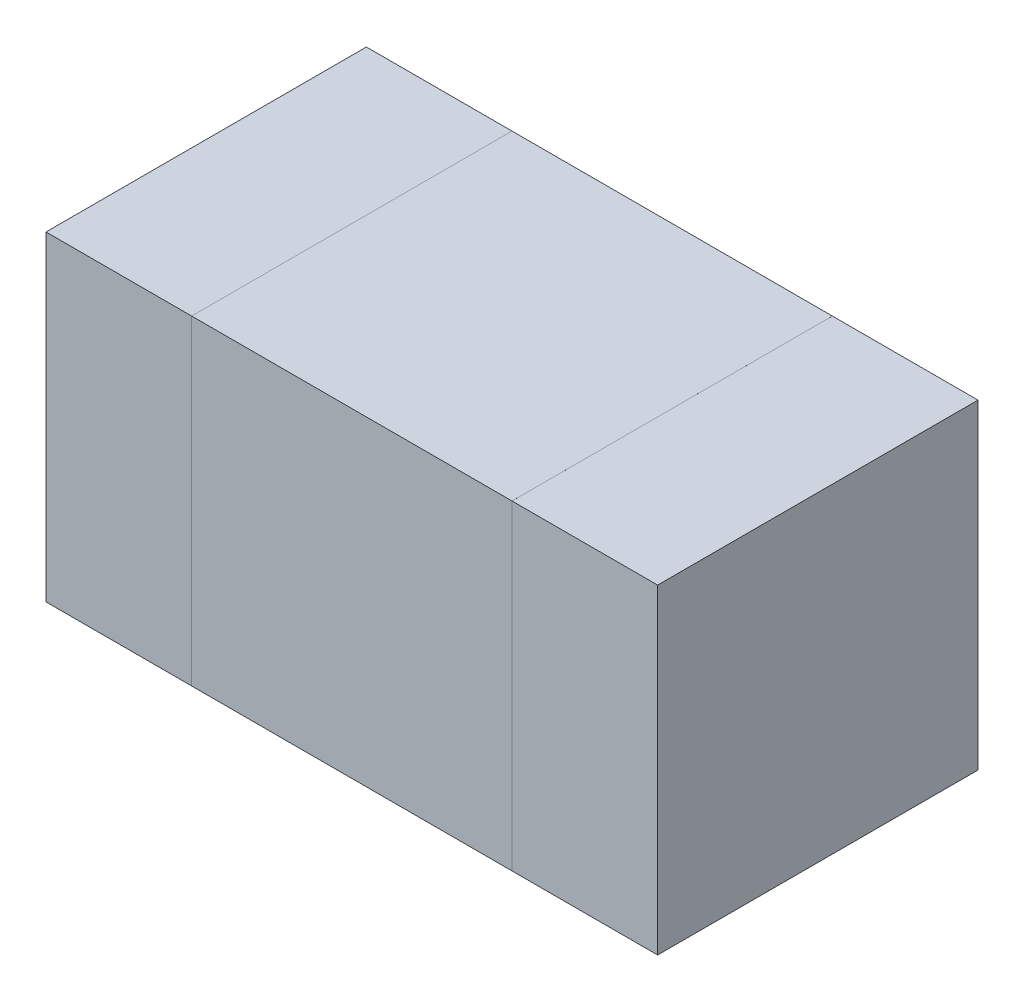
ISO-10303-21;
HEADER;
FILE_DESCRIPTION(('STEP AP214'),'2;1');
FILE_NAME('part.step','',(''),(''),'','','');
FILE_SCHEMA(('AUTOMOTIVE_DESIGN { 1 0 10303 214 1 1 1 1 }'));
ENDSEC;
DATA;
#1=APPLICATION_CONTEXT('core data for automotive mechanical design processes');
#2=APPLICATION_PROTOCOL_DEFINITION('international standard','automotive_design',2000,#1);
#3=PRODUCT_CONTEXT('',#1,'mechanical');
#4=PRODUCT('Part','Part','',(#3));
#5=PRODUCT_RELATED_PRODUCT_CATEGORY('part','',(#4));
#6=PRODUCT_DEFINITION_FORMATION('','',#4);
#7=PRODUCT_DEFINITION_CONTEXT('part definition',#1,'design');
#8=PRODUCT_DEFINITION('design','',#6,#7);
#9=PRODUCT_DEFINITION_SHAPE('','',#8);
#10=(LENGTH_UNIT() NAMED_UNIT(*) SI_UNIT(.MILLI.,.METRE.));
#11=(NAMED_UNIT(*) PLANE_ANGLE_UNIT() SI_UNIT($,.RADIAN.));
#12=(NAMED_UNIT(*) SI_UNIT($,.STERADIAN.) SOLID_ANGLE_UNIT());
#13=UNCERTAINTY_MEASURE_WITH_UNIT(LENGTH_MEASURE(1.E-05),#10,'distance_accuracy_value','');
#14=(GEOMETRIC_REPRESENTATION_CONTEXT(3) GLOBAL_UNCERTAINTY_ASSIGNED_CONTEXT((#13)) GLOBAL_UNIT_ASSIGNED_CONTEXT((#10,
#11,#12)) REPRESENTATION_CONTEXT('',''));
#15=CARTESIAN_POINT('',(0.,0.,0.));
#16=DIRECTION('',(0.,0.,1.));
#17=DIRECTION('',(1.,0.,0.));
#18=AXIS2_PLACEMENT_3D('',#15,#16,#17);
#19=CARTESIAN_POINT('',(6.610005851563,12.279995589141,0.32999934));
#20=DIRECTION('',(0.,0.,-1.));
#21=DIRECTION('',(0.,-1.,0.));
#22=AXIS2_PLACEMENT_3D('',#19,#20,#21);
#23=PLANE('',#22);
#24=DIRECTION('',(0.,1.,0.));
#25=VECTOR('',#24,1.);
#26=CARTESIAN_POINT('',(6.610005851563,12.279995589141,0.32999934));
#27=LINE('',#26,#25);
#28=CARTESIAN_POINT('',(6.610005851563,12.279995589141,0.32999934));
#29=VERTEX_POINT('',#28);
#30=CARTESIAN_POINT('',(6.610005851563,12.609997469141,0.32999934));
#31=VERTEX_POINT('',#30);
#32=EDGE_CURVE('P0_E93',#29,#31,#27,.T.);
#33=ORIENTED_EDGE('',*,*,#32,.T.);
#34=DIRECTION('',(-1.,0.,0.));
#35=VECTOR('',#34,1.);
#36=CARTESIAN_POINT('',(6.610005851563,12.609997469141,0.32999934));
#37=LINE('',#36,#35);
#38=CARTESIAN_POINT('',(6.460003611563,12.609997469141,0.32999934));
#39=VERTEX_POINT('',#38);
#40=EDGE_CURVE('P0_E71',#31,#39,#37,.T.);
#41=ORIENTED_EDGE('',*,*,#40,.T.);
#42=DIRECTION('',(0.,-1.,0.));
#43=VECTOR('',#42,1.);
#44=CARTESIAN_POINT('',(6.460003611563,12.609997469141,0.32999934));
#45=LINE('',#44,#43);
#46=CARTESIAN_POINT('',(6.460003611563,12.279995589141,0.32999934));
#47=VERTEX_POINT('',#46);
#48=EDGE_CURVE('P0_E76',#39,#47,#45,.T.);
#49=ORIENTED_EDGE('',*,*,#48,.T.);
#50=DIRECTION('',(1.,0.,0.));
#51=VECTOR('',#50,1.);
#52=CARTESIAN_POINT('',(6.460003611563,12.279995589141,0.32999934));
#53=LINE('',#52,#51);
#54=EDGE_CURVE('P0_E11',#47,#29,#53,.T.);
#55=ORIENTED_EDGE('',*,*,#54,.T.);
#56=EDGE_LOOP('',(#33,#41,#49,#55));
#57=FACE_BOUND('',#56,.T.);
#58=ADVANCED_FACE('P0_F17',(#57),#23,.F.);
#59=CARTESIAN_POINT('',(6.610005851563,12.279995589141,0.));
#60=DIRECTION('',(0.,0.,-1.));
#61=DIRECTION('',(0.,-1.,0.));
#62=AXIS2_PLACEMENT_3D('',#59,#60,#61);
#63=PLANE('',#62);
#64=DIRECTION('',(1.,0.,0.));
#65=VECTOR('',#64,1.);
#66=CARTESIAN_POINT('',(6.460003611563,12.279995589141,0.));
#67=LINE('',#66,#65);
#68=CARTESIAN_POINT('',(6.460003611563,12.279995589141,0.));
#69=VERTEX_POINT('',#68);
#70=CARTESIAN_POINT('',(6.610005851563,12.279995589141,0.));
#71=VERTEX_POINT('',#70);
#72=EDGE_CURVE('P0_E25',#69,#71,#67,.T.);
#73=ORIENTED_EDGE('',*,*,#72,.F.);
#74=DIRECTION('',(0.,-1.,0.));
#75=VECTOR('',#74,1.);
#76=CARTESIAN_POINT('',(6.460003611563,12.609997469141,0.));
#77=LINE('',#76,#75);
#78=CARTESIAN_POINT('',(6.460003611563,12.609997469141,0.));
#79=VERTEX_POINT('',#78);
#80=EDGE_CURVE('P0_E60',#79,#69,#77,.T.);
#81=ORIENTED_EDGE('',*,*,#80,.F.);
#82=DIRECTION('',(-1.,0.,0.));
#83=VECTOR('',#82,1.);
#84=CARTESIAN_POINT('',(6.610005851563,12.609997469141,0.));
#85=LINE('',#84,#83);
#86=CARTESIAN_POINT('',(6.610005851563,12.609997469141,0.));
#87=VERTEX_POINT('',#86);
#88=EDGE_CURVE('P0_E65',#87,#79,#85,.T.);
#89=ORIENTED_EDGE('',*,*,#88,.F.);
#90=DIRECTION('',(0.,1.,0.));
#91=VECTOR('',#90,1.);
#92=CARTESIAN_POINT('',(6.610005851563,12.279995589141,0.));
#93=LINE('',#92,#91);
#94=EDGE_CURVE('P0_E97',#71,#87,#93,.T.);
#95=ORIENTED_EDGE('',*,*,#94,.F.);
#96=EDGE_LOOP('',(#73,#81,#89,#95));
#97=FACE_BOUND('',#96,.T.);
#98=ADVANCED_FACE('P0_F62',(#97),#63,.T.);
#99=CARTESIAN_POINT('',(6.460003611563,12.279995589141,0.));
#100=DIRECTION('',(0.,1.,0.));
#101=DIRECTION('',(1.,0.,0.));
#102=AXIS2_PLACEMENT_3D('',#99,#100,#101);
#103=PLANE('',#102);
#104=ORIENTED_EDGE('',*,*,#72,.T.);
#105=DIRECTION('',(0.,0.,1.));
#106=VECTOR('',#105,1.);
#107=CARTESIAN_POINT('',(6.610005851563,12.279995589141,0.));
#108=LINE('',#107,#106);
#109=EDGE_CURVE('P0_E87',#71,#29,#108,.T.);
#110=ORIENTED_EDGE('',*,*,#109,.T.);
#111=ORIENTED_EDGE('',*,*,#54,.F.);
#112=DIRECTION('',(0.,0.,1.));
#113=VECTOR('',#112,1.);
#114=CARTESIAN_POINT('',(6.460003611563,12.279995589141,0.));
#115=LINE('',#114,#113);
#116=EDGE_CURVE('P0_E70',#69,#47,#115,.T.);
#117=ORIENTED_EDGE('',*,*,#116,.F.);
#118=EDGE_LOOP('',(#104,#110,#111,#117));
#119=FACE_BOUND('',#118,.T.);
#120=ADVANCED_FACE('P0_F113',(#119),#103,.F.);
#121=CARTESIAN_POINT('',(6.460003611563,12.609997469141,0.));
#122=DIRECTION('',(1.,0.,0.));
#123=DIRECTION('',(0.,1.,0.));
#124=AXIS2_PLACEMENT_3D('',#121,#122,#123);
#125=PLANE('',#124);
#126=ORIENTED_EDGE('',*,*,#80,.T.);
#127=ORIENTED_EDGE('',*,*,#116,.T.);
#128=ORIENTED_EDGE('',*,*,#48,.F.);
#129=DIRECTION('',(0.,0.,1.));
#130=VECTOR('',#129,1.);
#131=CARTESIAN_POINT('',(6.460003611563,12.609997469141,0.));
#132=LINE('',#131,#130);
#133=EDGE_CURVE('P0_E74',#79,#39,#132,.T.);
#134=ORIENTED_EDGE('',*,*,#133,.F.);
#135=EDGE_LOOP('',(#126,#127,#128,#134));
#136=FACE_BOUND('',#135,.T.);
#137=ADVANCED_FACE('P0_F75',(#136),#125,.F.);
#138=CARTESIAN_POINT('',(6.610005851563,12.609997469141,0.));
#139=DIRECTION('',(0.,-1.,0.));
#140=DIRECTION('',(0.,0.,-1.));
#141=AXIS2_PLACEMENT_3D('',#138,#139,#140);
#142=PLANE('',#141);
#143=ORIENTED_EDGE('',*,*,#88,.T.);
#144=ORIENTED_EDGE('',*,*,#133,.T.);
#145=ORIENTED_EDGE('',*,*,#40,.F.);
#146=DIRECTION('',(0.,0.,1.));
#147=VECTOR('',#146,1.);
#148=CARTESIAN_POINT('',(6.610005851563,12.609997469141,0.));
#149=LINE('',#148,#147);
#150=EDGE_CURVE('P0_E84',#87,#31,#149,.T.);
#151=ORIENTED_EDGE('',*,*,#150,.F.);
#152=EDGE_LOOP('',(#143,#144,#145,#151));
#153=FACE_BOUND('',#152,.T.);
#154=ADVANCED_FACE('P0_F82',(#153),#142,.F.);
#155=CARTESIAN_POINT('',(6.610005851563,12.279995589141,0.));
#156=DIRECTION('',(-1.,0.,0.));
#157=DIRECTION('',(0.,0.,1.));
#158=AXIS2_PLACEMENT_3D('',#155,#156,#157);
#159=PLANE('',#158);
#160=ORIENTED_EDGE('',*,*,#94,.T.);
#161=ORIENTED_EDGE('',*,*,#150,.T.);
#162=ORIENTED_EDGE('',*,*,#32,.F.);
#163=ORIENTED_EDGE('',*,*,#109,.F.);
#164=EDGE_LOOP('',(#160,#161,#162,#163));
#165=FACE_BOUND('',#164,.T.);
#166=ADVANCED_FACE('P0_F157',(#165),#159,.F.);
#167=CLOSED_SHELL('',(#58,#98,#120,#137,#154,#166));
#168=MANIFOLD_SOLID_BREP('P0_B1',#167);
#169=CARTESIAN_POINT('',(7.090001579102,12.279995589141,0.32999934));
#170=DIRECTION('',(0.,0.,-1.));
#171=DIRECTION('',(0.,-1.,0.));
#172=AXIS2_PLACEMENT_3D('',#169,#170,#171);
#173=PLANE('',#172);
#174=DIRECTION('',(0.,1.,0.));
#175=VECTOR('',#174,1.);
#176=CARTESIAN_POINT('',(7.090001579102,12.279995589141,0.32999934));
#177=LINE('',#176,#175);
#178=CARTESIAN_POINT('',(7.090001579102,12.279995589141,0.32999934));
#179=VERTEX_POINT('',#178);
#180=CARTESIAN_POINT('',(7.090001579102,12.609997469141,0.32999934));
#181=VERTEX_POINT('',#180);
#182=EDGE_CURVE('P1_E84',#179,#181,#177,.T.);
#183=ORIENTED_EDGE('',*,*,#182,.T.);
#184=DIRECTION('',(-1.,0.,0.));
#185=VECTOR('',#184,1.);
#186=CARTESIAN_POINT('',(7.090001579102,12.609997469141,0.32999934));
#187=LINE('',#186,#185);
#188=CARTESIAN_POINT('',(6.939999339102,12.609997469141,0.32999934));
#189=VERTEX_POINT('',#188);
#190=EDGE_CURVE('P1_E107',#181,#189,#187,.T.);
#191=ORIENTED_EDGE('',*,*,#190,.T.);
#192=DIRECTION('',(0.,-1.,0.));
#193=VECTOR('',#192,1.);
#194=CARTESIAN_POINT('',(6.939999339102,12.609997469141,0.32999934));
#195=LINE('',#194,#193);
#196=CARTESIAN_POINT('',(6.939999339102,12.279995589141,0.32999934));
#197=VERTEX_POINT('',#196);
#198=EDGE_CURVE('P1_E21',#189,#197,#195,.T.);
#199=ORIENTED_EDGE('',*,*,#198,.T.);
#200=DIRECTION('',(1.,0.,0.));
#201=VECTOR('',#200,1.);
#202=CARTESIAN_POINT('',(6.939999339102,12.279995589141,0.32999934));
#203=LINE('',#202,#201);
#204=EDGE_CURVE('P1_E11',#197,#179,#203,.T.);
#205=ORIENTED_EDGE('',*,*,#204,.T.);
#206=EDGE_LOOP('',(#183,#191,#199,#205));
#207=FACE_BOUND('',#206,.T.);
#208=ADVANCED_FACE('P1_F17',(#207),#173,.F.);
#209=CARTESIAN_POINT('',(7.090001579102,12.279995589141,0.));
#210=DIRECTION('',(0.,0.,-1.));
#211=DIRECTION('',(0.,-1.,0.));
#212=AXIS2_PLACEMENT_3D('',#209,#210,#211);
#213=PLANE('',#212);
#214=DIRECTION('',(1.,0.,0.));
#215=VECTOR('',#214,1.);
#216=CARTESIAN_POINT('',(6.939999339102,12.279995589141,0.));
#217=LINE('',#216,#215);
#218=CARTESIAN_POINT('',(6.939999339102,12.279995589141,0.));
#219=VERTEX_POINT('',#218);
#220=CARTESIAN_POINT('',(7.090001579102,12.279995589141,0.));
#221=VERTEX_POINT('',#220);
#222=EDGE_CURVE('P1_E27',#219,#221,#217,.T.);
#223=ORIENTED_EDGE('',*,*,#222,.F.);
#224=DIRECTION('',(0.,-1.,0.));
#225=VECTOR('',#224,1.);
#226=CARTESIAN_POINT('',(6.939999339102,12.609997469141,0.));
#227=LINE('',#226,#225);
#228=CARTESIAN_POINT('',(6.939999339102,12.609997469141,0.));
#229=VERTEX_POINT('',#228);
#230=EDGE_CURVE('P1_E101',#229,#219,#227,.T.);
#231=ORIENTED_EDGE('',*,*,#230,.F.);
#232=DIRECTION('',(-1.,0.,0.));
#233=VECTOR('',#232,1.);
#234=CARTESIAN_POINT('',(7.090001579102,12.609997469141,0.));
#235=LINE('',#234,#233);
#236=CARTESIAN_POINT('',(7.090001579102,12.609997469141,0.));
#237=VERTEX_POINT('',#236);
#238=EDGE_CURVE('P1_E86',#237,#229,#235,.T.);
#239=ORIENTED_EDGE('',*,*,#238,.F.);
#240=DIRECTION('',(0.,1.,0.));
#241=VECTOR('',#240,1.);
#242=CARTESIAN_POINT('',(7.090001579102,12.279995589141,0.));
#243=LINE('',#242,#241);
#244=EDGE_CURVE('P1_E82',#221,#237,#243,.T.);
#245=ORIENTED_EDGE('',*,*,#244,.F.);
#246=EDGE_LOOP('',(#223,#231,#239,#245));
#247=FACE_BOUND('',#246,.T.);
#248=ADVANCED_FACE('P1_F19',(#247),#213,.T.);
#249=CARTESIAN_POINT('',(6.939999339102,12.279995589141,0.));
#250=DIRECTION('',(0.,1.,0.));
#251=DIRECTION('',(1.,0.,0.));
#252=AXIS2_PLACEMENT_3D('',#249,#250,#251);
#253=PLANE('',#252);
#254=ORIENTED_EDGE('',*,*,#222,.T.);
#255=DIRECTION('',(0.,0.,1.));
#256=VECTOR('',#255,1.);
#257=CARTESIAN_POINT('',(7.090001579102,12.279995589141,0.));
#258=LINE('',#257,#256);
#259=EDGE_CURVE('P1_E71',#221,#179,#258,.T.);
#260=ORIENTED_EDGE('',*,*,#259,.T.);
#261=ORIENTED_EDGE('',*,*,#204,.F.);
#262=DIRECTION('',(0.,0.,1.));
#263=VECTOR('',#262,1.);
#264=CARTESIAN_POINT('',(6.939999339102,12.279995589141,0.));
#265=LINE('',#264,#263);
#266=EDGE_CURVE('P1_E74',#219,#197,#265,.T.);
#267=ORIENTED_EDGE('',*,*,#266,.F.);
#268=EDGE_LOOP('',(#254,#260,#261,#267));
#269=FACE_BOUND('',#268,.T.);
#270=ADVANCED_FACE('P1_F70',(#269),#253,.F.);
#271=CARTESIAN_POINT('',(6.939999339102,12.609997469141,0.));
#272=DIRECTION('',(1.,0.,0.));
#273=DIRECTION('',(0.,1.,0.));
#274=AXIS2_PLACEMENT_3D('',#271,#272,#273);
#275=PLANE('',#274);
#276=ORIENTED_EDGE('',*,*,#230,.T.);
#277=ORIENTED_EDGE('',*,*,#266,.T.);
#278=ORIENTED_EDGE('',*,*,#198,.F.);
#279=DIRECTION('',(0.,0.,1.));
#280=VECTOR('',#279,1.);
#281=CARTESIAN_POINT('',(6.939999339102,12.609997469141,0.));
#282=LINE('',#281,#280);
#283=EDGE_CURVE('P1_E104',#229,#189,#282,.T.);
#284=ORIENTED_EDGE('',*,*,#283,.F.);
#285=EDGE_LOOP('',(#276,#277,#278,#284));
#286=FACE_BOUND('',#285,.T.);
#287=ADVANCED_FACE('P1_F116',(#286),#275,.F.);
#288=CARTESIAN_POINT('',(7.090001579102,12.609997469141,0.));
#289=DIRECTION('',(0.,-1.,0.));
#290=DIRECTION('',(0.,0.,-1.));
#291=AXIS2_PLACEMENT_3D('',#288,#289,#290);
#292=PLANE('',#291);
#293=ORIENTED_EDGE('',*,*,#238,.T.);
#294=ORIENTED_EDGE('',*,*,#283,.T.);
#295=ORIENTED_EDGE('',*,*,#190,.F.);
#296=DIRECTION('',(0.,0.,1.));
#297=VECTOR('',#296,1.);
#298=CARTESIAN_POINT('',(7.090001579102,12.609997469141,0.));
#299=LINE('',#298,#297);
#300=EDGE_CURVE('P1_E91',#237,#181,#299,.T.);
#301=ORIENTED_EDGE('',*,*,#300,.F.);
#302=EDGE_LOOP('',(#293,#294,#295,#301));
#303=FACE_BOUND('',#302,.T.);
#304=ADVANCED_FACE('P1_F118',(#303),#292,.F.);
#305=CARTESIAN_POINT('',(7.090001579102,12.279995589141,0.));
#306=DIRECTION('',(-1.,0.,0.));
#307=DIRECTION('',(0.,0.,1.));
#308=AXIS2_PLACEMENT_3D('',#305,#306,#307);
#309=PLANE('',#308);
#310=ORIENTED_EDGE('',*,*,#244,.T.);
#311=ORIENTED_EDGE('',*,*,#300,.T.);
#312=ORIENTED_EDGE('',*,*,#182,.F.);
#313=ORIENTED_EDGE('',*,*,#259,.F.);
#314=EDGE_LOOP('',(#310,#311,#312,#313));
#315=FACE_BOUND('',#314,.T.);
#316=ADVANCED_FACE('P1_F80',(#315),#309,.F.);
#317=CLOSED_SHELL('',(#208,#248,#270,#287,#304,#316));
#318=MANIFOLD_SOLID_BREP('P1_B1',#317);
#319=CARTESIAN_POINT('',(6.609994025938,12.279998129141,0.32999934));
#320=DIRECTION('',(0.,0.,-1.));
#321=DIRECTION('',(0.,-1.,0.));
#322=AXIS2_PLACEMENT_3D('',#319,#320,#321);
#323=PLANE('',#322);
#324=DIRECTION('',(1.,0.,0.));
#325=VECTOR('',#324,1.);
#326=CARTESIAN_POINT('',(6.609994025938,12.279998129141,0.32999934));
#327=LINE('',#326,#325);
#328=CARTESIAN_POINT('',(6.609994025938,12.279998129141,0.32999934));
#329=VERTEX_POINT('',#328);
#330=CARTESIAN_POINT('',(6.939995905938,12.279998129141,0.32999934));
#331=VERTEX_POINT('',#330);
#332=EDGE_CURVE('P2_E82',#329,#331,#327,.T.);
#333=ORIENTED_EDGE('',*,*,#332,.T.);
#334=DIRECTION('',(0.,1.,0.));
#335=VECTOR('',#334,1.);
#336=CARTESIAN_POINT('',(6.939995905938,12.279998129141,0.32999934));
#337=LINE('',#336,#335);
#338=CARTESIAN_POINT('',(6.939995905938,12.609997469141,0.32999934));
#339=VERTEX_POINT('',#338);
#340=EDGE_CURVE('P2_E106',#331,#339,#337,.T.);
#341=ORIENTED_EDGE('',*,*,#340,.T.);
#342=DIRECTION('',(-1.,0.,0.));
#343=VECTOR('',#342,1.);
#344=CARTESIAN_POINT('',(6.939995905938,12.609997469141,0.32999934));
#345=LINE('',#344,#343);
#346=CARTESIAN_POINT('',(6.609994025938,12.609997469141,0.32999934));
#347=VERTEX_POINT('',#346);
#348=EDGE_CURVE('P2_E75',#339,#347,#345,.T.);
#349=ORIENTED_EDGE('',*,*,#348,.T.);
#350=DIRECTION('',(0.,-1.,0.));
#351=VECTOR('',#350,1.);
#352=CARTESIAN_POINT('',(6.609994025938,12.609997469141,0.32999934));
#353=LINE('',#352,#351);
#354=EDGE_CURVE('P2_E11',#347,#329,#353,.T.);
#355=ORIENTED_EDGE('',*,*,#354,.T.);
#356=EDGE_LOOP('',(#333,#341,#349,#355));
#357=FACE_BOUND('',#356,.T.);
#358=ADVANCED_FACE('P2_F17',(#357),#323,.F.);
#359=CARTESIAN_POINT('',(6.609994025938,12.279998129141,0.));
#360=DIRECTION('',(0.,0.,-1.));
#361=DIRECTION('',(0.,-1.,0.));
#362=AXIS2_PLACEMENT_3D('',#359,#360,#361);
#363=PLANE('',#362);
#364=DIRECTION('',(0.,-1.,0.));
#365=VECTOR('',#364,1.);
#366=CARTESIAN_POINT('',(6.609994025938,12.609997469141,0.));
#367=LINE('',#366,#365);
#368=CARTESIAN_POINT('',(6.609994025938,12.609997469141,0.));
#369=VERTEX_POINT('',#368);
#370=CARTESIAN_POINT('',(6.609994025938,12.279998129141,0.));
#371=VERTEX_POINT('',#370);
#372=EDGE_CURVE('P2_E20',#369,#371,#367,.T.);
#373=ORIENTED_EDGE('',*,*,#372,.F.);
#374=DIRECTION('',(-1.,0.,0.));
#375=VECTOR('',#374,1.);
#376=CARTESIAN_POINT('',(6.939995905938,12.609997469141,0.));
#377=LINE('',#376,#375);
#378=CARTESIAN_POINT('',(6.939995905938,12.609997469141,0.));
#379=VERTEX_POINT('',#378);
#380=EDGE_CURVE('P2_E110',#379,#369,#377,.T.);
#381=ORIENTED_EDGE('',*,*,#380,.F.);
#382=DIRECTION('',(0.,1.,0.));
#383=VECTOR('',#382,1.);
#384=CARTESIAN_POINT('',(6.939995905938,12.279998129141,0.));
#385=LINE('',#384,#383);
#386=CARTESIAN_POINT('',(6.939995905938,12.279998129141,0.));
#387=VERTEX_POINT('',#386);
#388=EDGE_CURVE('P2_E84',#387,#379,#385,.T.);
#389=ORIENTED_EDGE('',*,*,#388,.F.);
#390=DIRECTION('',(1.,0.,0.));
#391=VECTOR('',#390,1.);
#392=CARTESIAN_POINT('',(6.609994025938,12.279998129141,0.));
#393=LINE('',#392,#391);
#394=EDGE_CURVE('P2_E80',#371,#387,#393,.T.);
#395=ORIENTED_EDGE('',*,*,#394,.F.);
#396=EDGE_LOOP('',(#373,#381,#389,#395));
#397=FACE_BOUND('',#396,.T.);
#398=ADVANCED_FACE('P2_F86',(#397),#363,.T.);
#399=CARTESIAN_POINT('',(6.609994025938,12.609997469141,0.));
#400=DIRECTION('',(1.,0.,0.));
#401=DIRECTION('',(0.,1.,0.));
#402=AXIS2_PLACEMENT_3D('',#399,#400,#401);
#403=PLANE('',#402);
#404=ORIENTED_EDGE('',*,*,#372,.T.);
#405=DIRECTION('',(0.,0.,1.));
#406=VECTOR('',#405,1.);
#407=CARTESIAN_POINT('',(6.609994025938,12.279998129141,0.));
#408=LINE('',#407,#406);
#409=EDGE_CURVE('P2_E69',#371,#329,#408,.T.);
#410=ORIENTED_EDGE('',*,*,#409,.T.);
#411=ORIENTED_EDGE('',*,*,#354,.F.);
#412=DIRECTION('',(0.,0.,1.));
#413=VECTOR('',#412,1.);
#414=CARTESIAN_POINT('',(6.609994025938,12.609997469141,0.));
#415=LINE('',#414,#413);
#416=EDGE_CURVE('P2_E72',#369,#347,#415,.T.);
#417=ORIENTED_EDGE('',*,*,#416,.F.);
#418=EDGE_LOOP('',(#404,#410,#411,#417));
#419=FACE_BOUND('',#418,.T.);
#420=ADVANCED_FACE('P2_F68',(#419),#403,.F.);
#421=CARTESIAN_POINT('',(6.939995905938,12.609997469141,0.));
#422=DIRECTION('',(0.,-1.,0.));
#423=DIRECTION('',(0.,0.,-1.));
#424=AXIS2_PLACEMENT_3D('',#421,#422,#423);
#425=PLANE('',#424);
#426=ORIENTED_EDGE('',*,*,#380,.T.);
#427=ORIENTED_EDGE('',*,*,#416,.T.);
#428=ORIENTED_EDGE('',*,*,#348,.F.);
#429=DIRECTION('',(0.,0.,1.));
#430=VECTOR('',#429,1.);
#431=CARTESIAN_POINT('',(6.939995905938,12.609997469141,0.));
#432=LINE('',#431,#430);
#433=EDGE_CURVE('P2_E99',#379,#339,#432,.T.);
#434=ORIENTED_EDGE('',*,*,#433,.F.);
#435=EDGE_LOOP('',(#426,#427,#428,#434));
#436=FACE_BOUND('',#435,.T.);
#437=ADVANCED_FACE('P2_F115',(#436),#425,.F.);
#438=CARTESIAN_POINT('',(6.939995905938,12.279998129141,0.));
#439=DIRECTION('',(-1.,0.,0.));
#440=DIRECTION('',(0.,0.,1.));
#441=AXIS2_PLACEMENT_3D('',#438,#439,#440);
#442=PLANE('',#441);
#443=ORIENTED_EDGE('',*,*,#388,.T.);
#444=ORIENTED_EDGE('',*,*,#433,.T.);
#445=ORIENTED_EDGE('',*,*,#340,.F.);
#446=DIRECTION('',(0.,0.,1.));
#447=VECTOR('',#446,1.);
#448=CARTESIAN_POINT('',(6.939995905938,12.279998129141,0.));
#449=LINE('',#448,#447);
#450=EDGE_CURVE('P2_E90',#387,#331,#449,.T.);
#451=ORIENTED_EDGE('',*,*,#450,.F.);
#452=EDGE_LOOP('',(#443,#444,#445,#451));
#453=FACE_BOUND('',#452,.T.);
#454=ADVANCED_FACE('P2_F118',(#453),#442,.F.);
#455=CARTESIAN_POINT('',(6.609994025938,12.279998129141,0.));
#456=DIRECTION('',(0.,1.,0.));
#457=DIRECTION('',(1.,0.,0.));
#458=AXIS2_PLACEMENT_3D('',#455,#456,#457);
#459=PLANE('',#458);
#460=ORIENTED_EDGE('',*,*,#394,.T.);
#461=ORIENTED_EDGE('',*,*,#450,.T.);
#462=ORIENTED_EDGE('',*,*,#332,.F.);
#463=ORIENTED_EDGE('',*,*,#409,.F.);
#464=EDGE_LOOP('',(#460,#461,#462,#463));
#465=FACE_BOUND('',#464,.T.);
#466=ADVANCED_FACE('P2_F78',(#465),#459,.F.);
#467=CLOSED_SHELL('',(#358,#398,#420,#437,#454,#466));
#468=MANIFOLD_SOLID_BREP('P2_B1',#467);
#469=ADVANCED_BREP_SHAPE_REPRESENTATION('',(#18,#168,#318,#468),#14);
#470=SHAPE_DEFINITION_REPRESENTATION(#9,#469);
ENDSEC;
END-ISO-10303-21;
